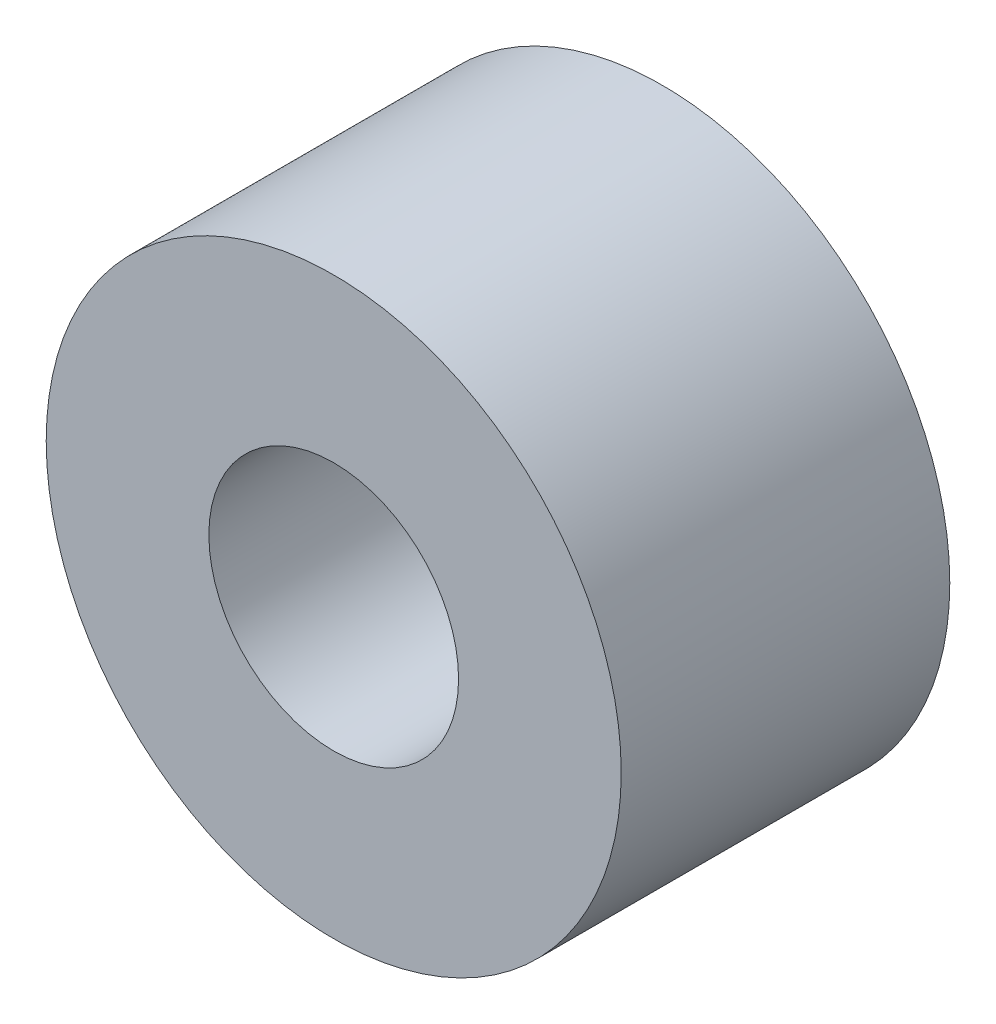
ISO-10303-21;
HEADER;
FILE_DESCRIPTION(('STEP AP214'),'2;1');
FILE_NAME('part.step','',(''),(''),'','','');
FILE_SCHEMA(('AUTOMOTIVE_DESIGN { 1 0 10303 214 1 1 1 1 }'));
ENDSEC;
DATA;
#1=APPLICATION_CONTEXT('core data for automotive mechanical design processes');
#2=APPLICATION_PROTOCOL_DEFINITION('international standard','automotive_design',2000,#1);
#3=PRODUCT_CONTEXT('',#1,'mechanical');
#4=PRODUCT('Part','Part','',(#3));
#5=PRODUCT_RELATED_PRODUCT_CATEGORY('part','',(#4));
#6=PRODUCT_DEFINITION_FORMATION('','',#4);
#7=PRODUCT_DEFINITION_CONTEXT('part definition',#1,'design');
#8=PRODUCT_DEFINITION('design','',#6,#7);
#9=PRODUCT_DEFINITION_SHAPE('','',#8);
#10=(LENGTH_UNIT() NAMED_UNIT(*) SI_UNIT(.MILLI.,.METRE.));
#11=(NAMED_UNIT(*) PLANE_ANGLE_UNIT() SI_UNIT($,.RADIAN.));
#12=(NAMED_UNIT(*) SI_UNIT($,.STERADIAN.) SOLID_ANGLE_UNIT());
#13=UNCERTAINTY_MEASURE_WITH_UNIT(LENGTH_MEASURE(1.E-05),#10,'distance_accuracy_value','');
#14=(GEOMETRIC_REPRESENTATION_CONTEXT(3) GLOBAL_UNCERTAINTY_ASSIGNED_CONTEXT((#13)) GLOBAL_UNIT_ASSIGNED_CONTEXT((#10,
#11,#12)) REPRESENTATION_CONTEXT('',''));
#15=CARTESIAN_POINT('',(0.,0.,0.));
#16=DIRECTION('',(0.,0.,1.));
#17=DIRECTION('',(1.,0.,0.));
#18=AXIS2_PLACEMENT_3D('',#15,#16,#17);
#19=CARTESIAN_POINT('',(0.,0.,3.175));
#20=DIRECTION('',(0.,0.,-1.));
#21=DIRECTION('',(-1.,0.,0.));
#22=AXIS2_PLACEMENT_3D('',#19,#20,#21);
#23=CYLINDRICAL_SURFACE('',#22,5.55625);
#24=CARTESIAN_POINT('',(0.,0.,3.175));
#25=DIRECTION('',(0.,0.,1.));
#26=DIRECTION('',(1.,0.,0.));
#27=AXIS2_PLACEMENT_3D('',#24,#25,#26);
#28=CIRCLE('',#27,5.55625);
#29=CARTESIAN_POINT('',(5.55625,0.,3.175));
#30=VERTEX_POINT('',#29);
#31=EDGE_CURVE('E10',#30,#30,#28,.T.);
#32=ORIENTED_EDGE('',*,*,#31,.F.);
#33=EDGE_LOOP('',(#32));
#34=FACE_BOUND('',#33,.T.);
#35=CARTESIAN_POINT('',(0.,0.,-3.175));
#36=DIRECTION('',(0.,0.,1.));
#37=DIRECTION('',(1.,0.,0.));
#38=AXIS2_PLACEMENT_3D('',#35,#36,#37);
#39=CIRCLE('',#38,5.55625);
#40=CARTESIAN_POINT('',(5.55625,0.,-3.175));
#41=VERTEX_POINT('',#40);
#42=EDGE_CURVE('E33',#41,#41,#39,.T.);
#43=ORIENTED_EDGE('',*,*,#42,.T.);
#44=EDGE_LOOP('',(#43));
#45=FACE_BOUND('',#44,.T.);
#46=ADVANCED_FACE('F30',(#34,#45),#23,.T.);
#47=CARTESIAN_POINT('',(0.,0.,3.175));
#48=DIRECTION('',(0.,0.,1.));
#49=DIRECTION('',(1.,0.,0.));
#50=AXIS2_PLACEMENT_3D('',#47,#48,#49);
#51=PLANE('',#50);
#52=CARTESIAN_POINT('',(0.,0.,3.175));
#53=DIRECTION('',(0.,0.,1.));
#54=DIRECTION('',(1.,0.,0.));
#55=AXIS2_PLACEMENT_3D('',#52,#53,#54);
#56=CIRCLE('',#55,2.413);
#57=CARTESIAN_POINT('',(2.413,0.,3.175));
#58=VERTEX_POINT('',#57);
#59=EDGE_CURVE('E42',#58,#58,#56,.T.);
#60=ORIENTED_EDGE('',*,*,#59,.F.);
#61=EDGE_LOOP('',(#60));
#62=FACE_BOUND('',#61,.T.);
#63=ORIENTED_EDGE('',*,*,#31,.T.);
#64=EDGE_LOOP('',(#63));
#65=FACE_BOUND('',#64,.T.);
#66=ADVANCED_FACE('F57',(#62,#65),#51,.T.);
#67=CARTESIAN_POINT('',(0.,0.,-3.175));
#68=DIRECTION('',(0.,0.,1.));
#69=DIRECTION('',(1.,0.,0.));
#70=AXIS2_PLACEMENT_3D('',#67,#68,#69);
#71=PLANE('',#70);
#72=CARTESIAN_POINT('',(0.,0.,-3.175));
#73=DIRECTION('',(0.,0.,1.));
#74=DIRECTION('',(1.,0.,0.));
#75=AXIS2_PLACEMENT_3D('',#72,#73,#74);
#76=CIRCLE('',#75,2.413);
#77=CARTESIAN_POINT('',(2.413,0.,-3.175));
#78=VERTEX_POINT('',#77);
#79=EDGE_CURVE('E40',#78,#78,#76,.T.);
#80=ORIENTED_EDGE('',*,*,#79,.T.);
#81=EDGE_LOOP('',(#80));
#82=FACE_BOUND('',#81,.T.);
#83=ORIENTED_EDGE('',*,*,#42,.F.);
#84=EDGE_LOOP('',(#83));
#85=FACE_BOUND('',#84,.T.);
#86=ADVANCED_FACE('F48',(#82,#85),#71,.F.);
#87=CARTESIAN_POINT('',(0.,0.,-3.175));
#88=DIRECTION('',(0.,0.,1.));
#89=DIRECTION('',(1.,0.,0.));
#90=AXIS2_PLACEMENT_3D('',#87,#88,#89);
#91=CYLINDRICAL_SURFACE('',#90,2.413);
#92=ORIENTED_EDGE('',*,*,#79,.F.);
#93=EDGE_LOOP('',(#92));
#94=FACE_BOUND('',#93,.T.);
#95=ORIENTED_EDGE('',*,*,#59,.T.);
#96=EDGE_LOOP('',(#95));
#97=FACE_BOUND('',#96,.T.);
#98=ADVANCED_FACE('F51',(#94,#97),#91,.F.);
#99=CLOSED_SHELL('',(#46,#66,#86,#98));
#100=MANIFOLD_SOLID_BREP('B2',#99);
#101=ADVANCED_BREP_SHAPE_REPRESENTATION('',(#18,#100),#14);
#102=SHAPE_DEFINITION_REPRESENTATION(#9,#101);
ENDSEC;
END-ISO-10303-21;
